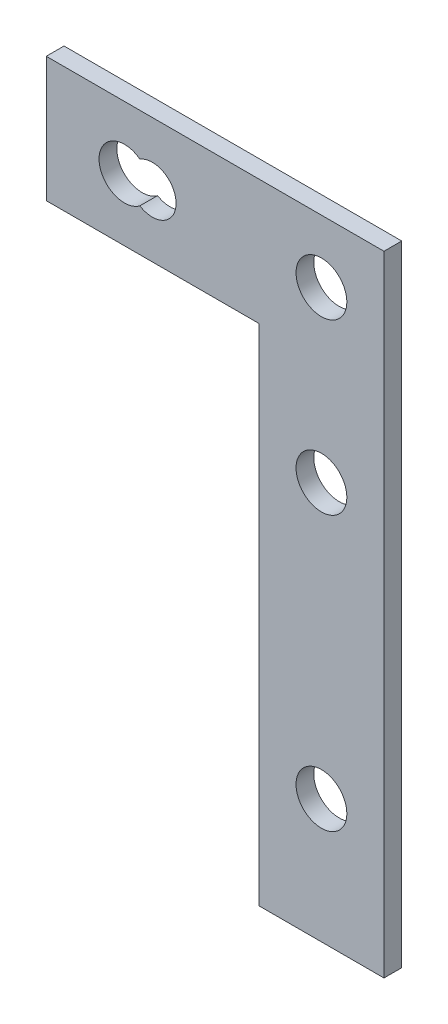
ISO-10303-21;
HEADER;
FILE_DESCRIPTION(('STEP AP214'),'2;1');
FILE_NAME('part.step','',(''),(''),'','','');
FILE_SCHEMA(('AUTOMOTIVE_DESIGN { 1 0 10303 214 1 1 1 1 }'));
ENDSEC;
DATA;
#1=APPLICATION_CONTEXT('core data for automotive mechanical design processes');
#2=APPLICATION_PROTOCOL_DEFINITION('international standard','automotive_design',2000,#1);
#3=PRODUCT_CONTEXT('',#1,'mechanical');
#4=PRODUCT('Part','Part','',(#3));
#5=PRODUCT_RELATED_PRODUCT_CATEGORY('part','',(#4));
#6=PRODUCT_DEFINITION_FORMATION('','',#4);
#7=PRODUCT_DEFINITION_CONTEXT('part definition',#1,'design');
#8=PRODUCT_DEFINITION('design','',#6,#7);
#9=PRODUCT_DEFINITION_SHAPE('','',#8);
#10=(LENGTH_UNIT() NAMED_UNIT(*) SI_UNIT(.MILLI.,.METRE.));
#11=(NAMED_UNIT(*) PLANE_ANGLE_UNIT() SI_UNIT($,.RADIAN.));
#12=(NAMED_UNIT(*) SI_UNIT($,.STERADIAN.) SOLID_ANGLE_UNIT());
#13=UNCERTAINTY_MEASURE_WITH_UNIT(LENGTH_MEASURE(1.E-05),#10,'distance_accuracy_value','');
#14=(GEOMETRIC_REPRESENTATION_CONTEXT(3) GLOBAL_UNCERTAINTY_ASSIGNED_CONTEXT((#13)) GLOBAL_UNIT_ASSIGNED_CONTEXT((#10,
#11,#12)) REPRESENTATION_CONTEXT('',''));
#15=CARTESIAN_POINT('',(0.,0.,0.));
#16=DIRECTION('',(0.,0.,1.));
#17=DIRECTION('',(1.,0.,0.));
#18=AXIS2_PLACEMENT_3D('',#15,#16,#17);
#19=CARTESIAN_POINT('',(19.2532,0.,-1.8034));
#20=DIRECTION('',(1.,0.,0.));
#21=DIRECTION('',(0.,0.,-1.));
#22=AXIS2_PLACEMENT_3D('',#19,#20,#21);
#23=PLANE('',#22);
#24=DIRECTION('',(0.,1.,0.));
#25=VECTOR('',#24,1.);
#26=CARTESIAN_POINT('',(19.2532,0.,0.));
#27=LINE('',#26,#25);
#28=CARTESIAN_POINT('',(19.2532,-31.9532,0.));
#29=VERTEX_POINT('',#28);
#30=CARTESIAN_POINT('',(19.2532,19.2532,0.));
#31=VERTEX_POINT('',#30);
#32=EDGE_CURVE('E163',#29,#31,#27,.T.);
#33=ORIENTED_EDGE('',*,*,#32,.T.);
#34=DIRECTION('',(0.,0.,1.));
#35=VECTOR('',#34,1.);
#36=CARTESIAN_POINT('',(19.2532,19.2532,-1.8034));
#37=LINE('',#36,#35);
#38=CARTESIAN_POINT('',(19.2532,19.2532,-1.8034));
#39=VERTEX_POINT('',#38);
#40=EDGE_CURVE('E141',#39,#31,#37,.T.);
#41=ORIENTED_EDGE('',*,*,#40,.F.);
#42=DIRECTION('',(0.,1.,0.));
#43=VECTOR('',#42,1.);
#44=CARTESIAN_POINT('',(19.2532,0.,-1.8034));
#45=LINE('',#44,#43);
#46=CARTESIAN_POINT('',(19.2532,-31.9532,-1.8034));
#47=VERTEX_POINT('',#46);
#48=EDGE_CURVE('E135',#47,#39,#45,.T.);
#49=ORIENTED_EDGE('',*,*,#48,.F.);
#50=DIRECTION('',(0.,0.,1.));
#51=VECTOR('',#50,1.);
#52=CARTESIAN_POINT('',(19.2532,-31.9532,-1.8034));
#53=LINE('',#52,#51);
#54=EDGE_CURVE('E148',#47,#29,#53,.T.);
#55=ORIENTED_EDGE('',*,*,#54,.T.);
#56=EDGE_LOOP('',(#33,#41,#49,#55));
#57=FACE_BOUND('',#56,.T.);
#58=ADVANCED_FACE('F48',(#57),#23,.F.);
#59=CARTESIAN_POINT('',(0.,19.2532,-1.8034));
#60=DIRECTION('',(0.,1.,0.));
#61=DIRECTION('',(0.,0.,1.));
#62=AXIS2_PLACEMENT_3D('',#59,#60,#61);
#63=PLANE('',#62);
#64=DIRECTION('',(-1.,0.,0.));
#65=VECTOR('',#64,1.);
#66=CARTESIAN_POINT('',(0.,19.2532,0.));
#67=LINE('',#66,#65);
#68=CARTESIAN_POINT('',(-2.33679999999999,19.2532,0.));
#69=VERTEX_POINT('',#68);
#70=EDGE_CURVE('E133',#31,#69,#67,.T.);
#71=ORIENTED_EDGE('',*,*,#70,.T.);
#72=DIRECTION('',(0.,0.,1.));
#73=VECTOR('',#72,1.);
#74=CARTESIAN_POINT('',(-2.33679999999999,19.2532,-2.54));
#75=LINE('',#74,#73);
#76=CARTESIAN_POINT('',(-2.33679999999999,19.2532,-1.8034));
#77=VERTEX_POINT('',#76);
#78=EDGE_CURVE('E62',#77,#69,#75,.T.);
#79=ORIENTED_EDGE('',*,*,#78,.F.);
#80=DIRECTION('',(-1.,0.,0.));
#81=VECTOR('',#80,1.);
#82=CARTESIAN_POINT('',(0.,19.2532,-1.8034));
#83=LINE('',#82,#81);
#84=EDGE_CURVE('E150',#39,#77,#83,.T.);
#85=ORIENTED_EDGE('',*,*,#84,.F.);
#86=ORIENTED_EDGE('',*,*,#40,.T.);
#87=EDGE_LOOP('',(#71,#79,#85,#86));
#88=FACE_BOUND('',#87,.T.);
#89=ADVANCED_FACE('F189',(#88),#63,.F.);
#90=CARTESIAN_POINT('',(0.,31.9532,-1.8034));
#91=DIRECTION('',(0.,1.,0.));
#92=DIRECTION('',(-1.,0.,0.));
#93=AXIS2_PLACEMENT_3D('',#90,#91,#92);
#94=PLANE('',#93);
#95=DIRECTION('',(0.,0.,1.));
#96=VECTOR('',#95,1.);
#97=CARTESIAN_POINT('',(-2.33679999999999,31.9532,-2.54));
#98=LINE('',#97,#96);
#99=CARTESIAN_POINT('',(-2.33679999999999,31.9532,-1.8034));
#100=VERTEX_POINT('',#99);
#101=CARTESIAN_POINT('',(-2.33679999999999,31.9532,0.));
#102=VERTEX_POINT('',#101);
#103=EDGE_CURVE('E112',#100,#102,#98,.T.);
#104=ORIENTED_EDGE('',*,*,#103,.T.);
#105=DIRECTION('',(-1.,0.,0.));
#106=VECTOR('',#105,1.);
#107=CARTESIAN_POINT('',(0.,31.9532,0.));
#108=LINE('',#107,#106);
#109=CARTESIAN_POINT('',(31.9532,31.9532,0.));
#110=VERTEX_POINT('',#109);
#111=EDGE_CURVE('E122',#110,#102,#108,.T.);
#112=ORIENTED_EDGE('',*,*,#111,.F.);
#113=DIRECTION('',(0.,0.,1.));
#114=VECTOR('',#113,1.);
#115=CARTESIAN_POINT('',(31.9532,31.9532,-1.8034));
#116=LINE('',#115,#114);
#117=CARTESIAN_POINT('',(31.9532,31.9532,-1.8034));
#118=VERTEX_POINT('',#117);
#119=EDGE_CURVE('E144',#118,#110,#116,.T.);
#120=ORIENTED_EDGE('',*,*,#119,.F.);
#121=DIRECTION('',(-1.,0.,0.));
#122=VECTOR('',#121,1.);
#123=CARTESIAN_POINT('',(0.,31.9532,-1.8034));
#124=LINE('',#123,#122);
#125=EDGE_CURVE('E125',#118,#100,#124,.T.);
#126=ORIENTED_EDGE('',*,*,#125,.T.);
#127=EDGE_LOOP('',(#104,#112,#120,#126));
#128=FACE_BOUND('',#127,.T.);
#129=ADVANCED_FACE('F121',(#128),#94,.T.);
#130=CARTESIAN_POINT('',(31.9532,0.,-1.8034));
#131=DIRECTION('',(1.,0.,0.));
#132=DIRECTION('',(0.,0.,-1.));
#133=AXIS2_PLACEMENT_3D('',#130,#131,#132);
#134=PLANE('',#133);
#135=DIRECTION('',(0.,1.,0.));
#136=VECTOR('',#135,1.);
#137=CARTESIAN_POINT('',(31.9532,0.,0.));
#138=LINE('',#137,#136);
#139=CARTESIAN_POINT('',(31.9532,-31.9532,0.));
#140=VERTEX_POINT('',#139);
#141=EDGE_CURVE('E132',#140,#110,#138,.T.);
#142=ORIENTED_EDGE('',*,*,#141,.F.);
#143=DIRECTION('',(0.,0.,1.));
#144=VECTOR('',#143,1.);
#145=CARTESIAN_POINT('',(31.9532,-31.9532,-1.8034));
#146=LINE('',#145,#144);
#147=CARTESIAN_POINT('',(31.9532,-31.9532,-1.8034));
#148=VERTEX_POINT('',#147);
#149=EDGE_CURVE('E146',#148,#140,#146,.T.);
#150=ORIENTED_EDGE('',*,*,#149,.F.);
#151=DIRECTION('',(0.,1.,0.));
#152=VECTOR('',#151,1.);
#153=CARTESIAN_POINT('',(31.9532,0.,-1.8034));
#154=LINE('',#153,#152);
#155=EDGE_CURVE('E175',#148,#118,#154,.T.);
#156=ORIENTED_EDGE('',*,*,#155,.T.);
#157=ORIENTED_EDGE('',*,*,#119,.T.);
#158=EDGE_LOOP('',(#142,#150,#156,#157));
#159=FACE_BOUND('',#158,.T.);
#160=ADVANCED_FACE('F192',(#159),#134,.T.);
#161=CARTESIAN_POINT('',(0.,-31.9532,-1.8034));
#162=DIRECTION('',(0.,1.,0.));
#163=DIRECTION('',(0.,0.,1.));
#164=AXIS2_PLACEMENT_3D('',#161,#162,#163);
#165=PLANE('',#164);
#166=DIRECTION('',(-1.,0.,0.));
#167=VECTOR('',#166,1.);
#168=CARTESIAN_POINT('',(0.,-31.9532,0.));
#169=LINE('',#168,#167);
#170=EDGE_CURVE('E137',#140,#29,#169,.T.);
#171=ORIENTED_EDGE('',*,*,#170,.T.);
#172=ORIENTED_EDGE('',*,*,#54,.F.);
#173=DIRECTION('',(-1.,0.,0.));
#174=VECTOR('',#173,1.);
#175=CARTESIAN_POINT('',(0.,-31.9532,-1.8034));
#176=LINE('',#175,#174);
#177=EDGE_CURVE('E173',#148,#47,#176,.T.);
#178=ORIENTED_EDGE('',*,*,#177,.F.);
#179=ORIENTED_EDGE('',*,*,#149,.T.);
#180=EDGE_LOOP('',(#171,#172,#178,#179));
#181=FACE_BOUND('',#180,.T.);
#182=ADVANCED_FACE('F182',(#181),#165,.F.);
#183=CARTESIAN_POINT('',(0.,0.,-1.8034));
#184=DIRECTION('',(0.,0.,1.));
#185=DIRECTION('',(1.,0.,0.));
#186=AXIS2_PLACEMENT_3D('',#183,#184,#185);
#187=PLANE('',#186);
#188=CARTESIAN_POINT('',(25.6032,8.43280000000001,-1.8034));
#189=DIRECTION('',(0.,0.,1.));
#190=DIRECTION('',(1.,0.,0.));
#191=AXIS2_PLACEMENT_3D('',#188,#189,#190);
#192=CIRCLE('',#191,2.579751);
#193=CARTESIAN_POINT('',(28.182951,8.43280000000001,-1.8034));
#194=VERTEX_POINT('',#193);
#195=EDGE_CURVE('E315',#194,#194,#192,.T.);
#196=ORIENTED_EDGE('',*,*,#195,.T.);
#197=EDGE_LOOP('',(#196));
#198=FACE_BOUND('',#197,.T.);
#199=CARTESIAN_POINT('',(25.6032,-19.3802,-1.8034));
#200=DIRECTION('',(0.,0.,1.));
#201=DIRECTION('',(1.,0.,0.));
#202=AXIS2_PLACEMENT_3D('',#199,#200,#201);
#203=CIRCLE('',#202,2.579751);
#204=CARTESIAN_POINT('',(28.182951,-19.3802,-1.8034));
#205=VERTEX_POINT('',#204);
#206=EDGE_CURVE('E329',#205,#205,#203,.T.);
#207=ORIENTED_EDGE('',*,*,#206,.T.);
#208=EDGE_LOOP('',(#207));
#209=FACE_BOUND('',#208,.T.);
#210=CARTESIAN_POINT('',(25.6032,25.6032,-1.8034));
#211=DIRECTION('',(0.,0.,1.));
#212=DIRECTION('',(1.,0.,0.));
#213=AXIS2_PLACEMENT_3D('',#210,#211,#212);
#214=CIRCLE('',#213,2.579751);
#215=CARTESIAN_POINT('',(28.182951,25.6032,-1.8034));
#216=VERTEX_POINT('',#215);
#217=EDGE_CURVE('E167',#216,#216,#214,.T.);
#218=ORIENTED_EDGE('',*,*,#217,.T.);
#219=EDGE_LOOP('',(#218));
#220=FACE_BOUND('',#219,.T.);
#221=CARTESIAN_POINT('',(8.43280000000001,25.6032,-1.8034));
#222=DIRECTION('',(0.,0.,1.));
#223=DIRECTION('',(1.,0.,0.));
#224=AXIS2_PLACEMENT_3D('',#221,#222,#223);
#225=CIRCLE('',#224,2.413);
#226=CARTESIAN_POINT('',(7.16511376555004,23.5500218267803,-1.8034));
#227=VERTEX_POINT('',#226);
#228=CARTESIAN_POINT('',(7.16511376555017,27.6563781732199,-1.8034));
#229=VERTEX_POINT('',#228);
#230=EDGE_CURVE('E156',#227,#229,#225,.T.);
#231=ORIENTED_EDGE('',*,*,#230,.T.);
#232=CARTESIAN_POINT('',(5.60320000000003,25.6032000000001,-1.8034));
#233=DIRECTION('',(0.,0.,1.));
#234=DIRECTION('',(1.,0.,0.));
#235=AXIS2_PLACEMENT_3D('',#232,#233,#234);
#236=CIRCLE('',#235,2.579751);
#237=EDGE_CURVE('E70',#229,#227,#236,.T.);
#238=ORIENTED_EDGE('',*,*,#237,.T.);
#239=EDGE_LOOP('',(#231,#238));
#240=FACE_BOUND('',#239,.T.);
#241=ORIENTED_EDGE('',*,*,#84,.T.);
#242=DIRECTION('',(0.,1.,0.));
#243=VECTOR('',#242,1.);
#244=CARTESIAN_POINT('',(-2.33679999999999,0.,-1.8034));
#245=LINE('',#244,#243);
#246=EDGE_CURVE('E126',#77,#100,#245,.T.);
#247=ORIENTED_EDGE('',*,*,#246,.T.);
#248=ORIENTED_EDGE('',*,*,#125,.F.);
#249=ORIENTED_EDGE('',*,*,#155,.F.);
#250=ORIENTED_EDGE('',*,*,#177,.T.);
#251=ORIENTED_EDGE('',*,*,#48,.T.);
#252=EDGE_LOOP('',(#241,#247,#248,#249,#250,#251));
#253=FACE_BOUND('',#252,.T.);
#254=ADVANCED_FACE('F161',(#198,#209,#220,#240,#253),#187,.F.);
#255=CARTESIAN_POINT('',(0.,0.,0.));
#256=DIRECTION('',(0.,0.,1.));
#257=DIRECTION('',(1.,0.,0.));
#258=AXIS2_PLACEMENT_3D('',#255,#256,#257);
#259=PLANE('',#258);
#260=DIRECTION('',(0.,1.,0.));
#261=VECTOR('',#260,1.);
#262=CARTESIAN_POINT('',(-2.33679999999999,31.9532,0.));
#263=LINE('',#262,#261);
#264=EDGE_CURVE('E109',#69,#102,#263,.T.);
#265=ORIENTED_EDGE('',*,*,#264,.F.);
#266=ORIENTED_EDGE('',*,*,#70,.F.);
#267=ORIENTED_EDGE('',*,*,#32,.F.);
#268=ORIENTED_EDGE('',*,*,#170,.F.);
#269=ORIENTED_EDGE('',*,*,#141,.T.);
#270=ORIENTED_EDGE('',*,*,#111,.T.);
#271=EDGE_LOOP('',(#265,#266,#267,#268,#269,#270));
#272=FACE_BOUND('',#271,.T.);
#273=CARTESIAN_POINT('',(5.60320000000003,25.6032000000001,0.));
#274=DIRECTION('',(0.,0.,1.));
#275=DIRECTION('',(1.,0.,0.));
#276=AXIS2_PLACEMENT_3D('',#273,#274,#275);
#277=CIRCLE('',#276,2.579751);
#278=CARTESIAN_POINT('',(7.16511376555017,27.6563781732199,0.));
#279=VERTEX_POINT('',#278);
#280=CARTESIAN_POINT('',(7.16511376555004,23.5500218267803,0.));
#281=VERTEX_POINT('',#280);
#282=EDGE_CURVE('E323',#279,#281,#277,.T.);
#283=ORIENTED_EDGE('',*,*,#282,.F.);
#284=CARTESIAN_POINT('',(8.43280000000001,25.6032,0.));
#285=DIRECTION('',(0.,0.,1.));
#286=DIRECTION('',(1.,0.,0.));
#287=AXIS2_PLACEMENT_3D('',#284,#285,#286);
#288=CIRCLE('',#287,2.413);
#289=EDGE_CURVE('E158',#281,#279,#288,.T.);
#290=ORIENTED_EDGE('',*,*,#289,.F.);
#291=EDGE_LOOP('',(#283,#290));
#292=FACE_BOUND('',#291,.T.);
#293=CARTESIAN_POINT('',(25.6032,8.43280000000001,0.));
#294=DIRECTION('',(0.,0.,1.));
#295=DIRECTION('',(1.,0.,0.));
#296=AXIS2_PLACEMENT_3D('',#293,#294,#295);
#297=CIRCLE('',#296,2.579751);
#298=CARTESIAN_POINT('',(28.182951,8.43280000000001,0.));
#299=VERTEX_POINT('',#298);
#300=EDGE_CURVE('E318',#299,#299,#297,.T.);
#301=ORIENTED_EDGE('',*,*,#300,.F.);
#302=EDGE_LOOP('',(#301));
#303=FACE_BOUND('',#302,.T.);
#304=CARTESIAN_POINT('',(25.6032,-19.3802,0.));
#305=DIRECTION('',(0.,0.,1.));
#306=DIRECTION('',(1.,0.,0.));
#307=AXIS2_PLACEMENT_3D('',#304,#305,#306);
#308=CIRCLE('',#307,2.579751);
#309=CARTESIAN_POINT('',(28.182951,-19.3802,0.));
#310=VERTEX_POINT('',#309);
#311=EDGE_CURVE('E321',#310,#310,#308,.T.);
#312=ORIENTED_EDGE('',*,*,#311,.F.);
#313=EDGE_LOOP('',(#312));
#314=FACE_BOUND('',#313,.T.);
#315=CARTESIAN_POINT('',(25.6032,25.6032,0.));
#316=DIRECTION('',(0.,0.,1.));
#317=DIRECTION('',(1.,0.,0.));
#318=AXIS2_PLACEMENT_3D('',#315,#316,#317);
#319=CIRCLE('',#318,2.579751);
#320=CARTESIAN_POINT('',(28.182951,25.6032,0.));
#321=VERTEX_POINT('',#320);
#322=EDGE_CURVE('E332',#321,#321,#319,.T.);
#323=ORIENTED_EDGE('',*,*,#322,.F.);
#324=EDGE_LOOP('',(#323));
#325=FACE_BOUND('',#324,.T.);
#326=ADVANCED_FACE('F128',(#272,#292,#303,#314,#325),#259,.T.);
#327=CARTESIAN_POINT('',(8.43280000000001,25.6032,0.));
#328=DIRECTION('',(0.,0.,1.));
#329=DIRECTION('',(1.,0.,0.));
#330=AXIS2_PLACEMENT_3D('',#327,#328,#329);
#331=CYLINDRICAL_SURFACE('',#330,2.413);
#332=ORIENTED_EDGE('',*,*,#230,.F.);
#333=DIRECTION('',(0.,0.,1.));
#334=VECTOR('',#333,1.);
#335=CARTESIAN_POINT('',(7.16511376555004,23.5500218267803,-0.9017));
#336=LINE('',#335,#334);
#337=EDGE_CURVE('E13',#227,#281,#336,.T.);
#338=ORIENTED_EDGE('',*,*,#337,.T.);
#339=ORIENTED_EDGE('',*,*,#289,.T.);
#340=DIRECTION('',(0.,0.,1.));
#341=VECTOR('',#340,1.);
#342=CARTESIAN_POINT('',(7.16511376555017,27.6563781732199,-0.9017));
#343=LINE('',#342,#341);
#344=EDGE_CURVE('E55',#279,#229,#343,.F.);
#345=ORIENTED_EDGE('',*,*,#344,.T.);
#346=EDGE_LOOP('',(#332,#338,#339,#345));
#347=FACE_BOUND('',#346,.T.);
#348=ADVANCED_FACE('F155',(#347),#331,.F.);
#349=CARTESIAN_POINT('',(25.6032,25.6032,0.));
#350=DIRECTION('',(0.,0.,1.));
#351=DIRECTION('',(1.,0.,0.));
#352=AXIS2_PLACEMENT_3D('',#349,#350,#351);
#353=CYLINDRICAL_SURFACE('',#352,2.579751);
#354=ORIENTED_EDGE('',*,*,#217,.F.);
#355=EDGE_LOOP('',(#354));
#356=FACE_BOUND('',#355,.T.);
#357=ORIENTED_EDGE('',*,*,#322,.T.);
#358=EDGE_LOOP('',(#357));
#359=FACE_BOUND('',#358,.T.);
#360=ADVANCED_FACE('F215',(#356,#359),#353,.F.);
#361=CARTESIAN_POINT('',(25.6032,-19.3802,0.));
#362=DIRECTION('',(0.,0.,1.));
#363=DIRECTION('',(1.,0.,0.));
#364=AXIS2_PLACEMENT_3D('',#361,#362,#363);
#365=CYLINDRICAL_SURFACE('',#364,2.579751);
#366=ORIENTED_EDGE('',*,*,#206,.F.);
#367=EDGE_LOOP('',(#366));
#368=FACE_BOUND('',#367,.T.);
#369=ORIENTED_EDGE('',*,*,#311,.T.);
#370=EDGE_LOOP('',(#369));
#371=FACE_BOUND('',#370,.T.);
#372=ADVANCED_FACE('F218',(#368,#371),#365,.F.);
#373=CARTESIAN_POINT('',(25.6032,8.43280000000001,0.));
#374=DIRECTION('',(0.,0.,1.));
#375=DIRECTION('',(1.,0.,0.));
#376=AXIS2_PLACEMENT_3D('',#373,#374,#375);
#377=CYLINDRICAL_SURFACE('',#376,2.579751);
#378=ORIENTED_EDGE('',*,*,#195,.F.);
#379=EDGE_LOOP('',(#378));
#380=FACE_BOUND('',#379,.T.);
#381=ORIENTED_EDGE('',*,*,#300,.T.);
#382=EDGE_LOOP('',(#381));
#383=FACE_BOUND('',#382,.T.);
#384=ADVANCED_FACE('F222',(#380,#383),#377,.F.);
#385=CARTESIAN_POINT('',(5.60320000000003,25.6032000000001,0.));
#386=DIRECTION('',(0.,0.,1.));
#387=DIRECTION('',(1.,0.,0.));
#388=AXIS2_PLACEMENT_3D('',#385,#386,#387);
#389=CYLINDRICAL_SURFACE('',#388,2.579751);
#390=ORIENTED_EDGE('',*,*,#237,.F.);
#391=ORIENTED_EDGE('',*,*,#344,.F.);
#392=ORIENTED_EDGE('',*,*,#282,.T.);
#393=ORIENTED_EDGE('',*,*,#337,.F.);
#394=EDGE_LOOP('',(#390,#391,#392,#393));
#395=FACE_BOUND('',#394,.T.);
#396=ADVANCED_FACE('F226',(#395),#389,.F.);
#397=CARTESIAN_POINT('',(-2.33679999999999,31.9532,-2.54));
#398=DIRECTION('',(1.,0.,0.));
#399=DIRECTION('',(0.,0.,-1.));
#400=AXIS2_PLACEMENT_3D('',#397,#398,#399);
#401=PLANE('',#400);
#402=ORIENTED_EDGE('',*,*,#78,.T.);
#403=ORIENTED_EDGE('',*,*,#264,.T.);
#404=ORIENTED_EDGE('',*,*,#103,.F.);
#405=ORIENTED_EDGE('',*,*,#246,.F.);
#406=EDGE_LOOP('',(#402,#403,#404,#405));
#407=FACE_BOUND('',#406,.T.);
#408=ADVANCED_FACE('F111',(#407),#401,.F.);
#409=CLOSED_SHELL('',(#58,#89,#129,#160,#182,#254,#326,#348,#360,#372,#384,#396,#408));
#410=MANIFOLD_SOLID_BREP('B2',#409);
#411=ADVANCED_BREP_SHAPE_REPRESENTATION('',(#18,#410),#14);
#412=SHAPE_DEFINITION_REPRESENTATION(#9,#411);
ENDSEC;
END-ISO-10303-21;
